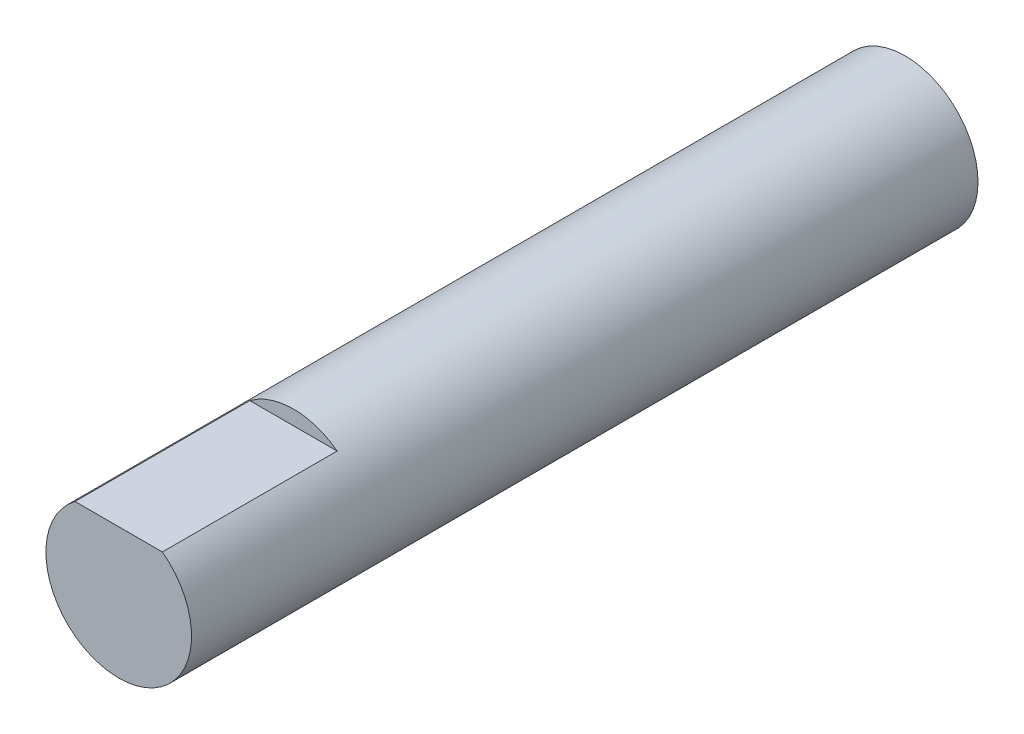
ISO-10303-21;
HEADER;
FILE_DESCRIPTION(('STEP AP214'),'2;1');
FILE_NAME('part.step','',(''),(''),'','','');
FILE_SCHEMA(('AUTOMOTIVE_DESIGN { 1 0 10303 214 1 1 1 1 }'));
ENDSEC;
DATA;
#1=APPLICATION_CONTEXT('core data for automotive mechanical design processes');
#2=APPLICATION_PROTOCOL_DEFINITION('international standard','automotive_design',2000,#1);
#3=PRODUCT_CONTEXT('',#1,'mechanical');
#4=PRODUCT('Part','Part','',(#3));
#5=PRODUCT_RELATED_PRODUCT_CATEGORY('part','',(#4));
#6=PRODUCT_DEFINITION_FORMATION('','',#4);
#7=PRODUCT_DEFINITION_CONTEXT('part definition',#1,'design');
#8=PRODUCT_DEFINITION('design','',#6,#7);
#9=PRODUCT_DEFINITION_SHAPE('','',#8);
#10=(LENGTH_UNIT() NAMED_UNIT(*) SI_UNIT(.MILLI.,.METRE.));
#11=(NAMED_UNIT(*) PLANE_ANGLE_UNIT() SI_UNIT($,.RADIAN.));
#12=(NAMED_UNIT(*) SI_UNIT($,.STERADIAN.) SOLID_ANGLE_UNIT());
#13=UNCERTAINTY_MEASURE_WITH_UNIT(LENGTH_MEASURE(1.E-05),#10,'distance_accuracy_value','');
#14=(GEOMETRIC_REPRESENTATION_CONTEXT(3) GLOBAL_UNCERTAINTY_ASSIGNED_CONTEXT((#13)) GLOBAL_UNIT_ASSIGNED_CONTEXT((#10,
#11,#12)) REPRESENTATION_CONTEXT('',''));
#15=CARTESIAN_POINT('',(0.,0.,0.));
#16=DIRECTION('',(0.,0.,1.));
#17=DIRECTION('',(1.,0.,0.));
#18=AXIS2_PLACEMENT_3D('',#15,#16,#17);
#19=CARTESIAN_POINT('',(0.,0.,27.));
#20=DIRECTION('',(0.,0.,-1.));
#21=DIRECTION('',(-1.,0.,0.));
#22=AXIS2_PLACEMENT_3D('',#19,#20,#21);
#23=CYLINDRICAL_SURFACE('',#22,2.5);
#24=CARTESIAN_POINT('',(0.,0.,27.));
#25=DIRECTION('',(0.,0.,1.));
#26=DIRECTION('',(1.,0.,0.));
#27=AXIS2_PLACEMENT_3D('',#24,#25,#26);
#28=CIRCLE('',#27,2.5);
#29=CARTESIAN_POINT('',(-1.5,2.,27.));
#30=VERTEX_POINT('',#29);
#31=CARTESIAN_POINT('',(1.5,2.,27.));
#32=VERTEX_POINT('',#31);
#33=EDGE_CURVE('E11',#30,#32,#28,.T.);
#34=ORIENTED_EDGE('',*,*,#33,.F.);
#35=DIRECTION('',(0.,0.,1.));
#36=VECTOR('',#35,1.);
#37=CARTESIAN_POINT('',(-1.5,2.,21.));
#38=LINE('',#37,#36);
#39=CARTESIAN_POINT('',(-1.5,2.,21.));
#40=VERTEX_POINT('',#39);
#41=EDGE_CURVE('E60',#40,#30,#38,.T.);
#42=ORIENTED_EDGE('',*,*,#41,.F.);
#43=CARTESIAN_POINT('',(0.,0.,21.));
#44=DIRECTION('',(0.,0.,1.));
#45=DIRECTION('',(1.,0.,0.));
#46=AXIS2_PLACEMENT_3D('',#43,#44,#45);
#47=CIRCLE('',#46,2.5);
#48=CARTESIAN_POINT('',(1.5,2.,21.));
#49=VERTEX_POINT('',#48);
#50=EDGE_CURVE('E76',#49,#40,#47,.T.);
#51=ORIENTED_EDGE('',*,*,#50,.F.);
#52=DIRECTION('',(0.,0.,1.));
#53=VECTOR('',#52,1.);
#54=CARTESIAN_POINT('',(1.5,2.,21.));
#55=LINE('',#54,#53);
#56=EDGE_CURVE('E66',#49,#32,#55,.T.);
#57=ORIENTED_EDGE('',*,*,#56,.T.);
#58=EDGE_LOOP('',(#34,#42,#51,#57));
#59=FACE_BOUND('',#58,.T.);
#60=CARTESIAN_POINT('',(0.,0.,0.));
#61=DIRECTION('',(0.,0.,1.));
#62=DIRECTION('',(1.,0.,0.));
#63=AXIS2_PLACEMENT_3D('',#60,#61,#62);
#64=CIRCLE('',#63,2.5);
#65=CARTESIAN_POINT('',(2.5,0.,0.));
#66=VERTEX_POINT('',#65);
#67=EDGE_CURVE('E48',#66,#66,#64,.T.);
#68=ORIENTED_EDGE('',*,*,#67,.T.);
#69=EDGE_LOOP('',(#68));
#70=FACE_BOUND('',#69,.T.);
#71=ADVANCED_FACE('F45',(#59,#70),#23,.T.);
#72=CARTESIAN_POINT('',(0.,0.,27.));
#73=DIRECTION('',(0.,0.,1.));
#74=DIRECTION('',(1.,0.,0.));
#75=AXIS2_PLACEMENT_3D('',#72,#73,#74);
#76=PLANE('',#75);
#77=DIRECTION('',(1.,0.,0.));
#78=VECTOR('',#77,1.);
#79=CARTESIAN_POINT('',(0.,2.,27.));
#80=LINE('',#79,#78);
#81=EDGE_CURVE('E71',#30,#32,#80,.T.);
#82=ORIENTED_EDGE('',*,*,#81,.F.);
#83=ORIENTED_EDGE('',*,*,#33,.T.);
#84=EDGE_LOOP('',(#82,#83));
#85=FACE_BOUND('',#84,.T.);
#86=ADVANCED_FACE('F83',(#85),#76,.T.);
#87=CARTESIAN_POINT('',(0.,0.,0.));
#88=DIRECTION('',(0.,0.,1.));
#89=DIRECTION('',(1.,0.,0.));
#90=AXIS2_PLACEMENT_3D('',#87,#88,#89);
#91=PLANE('',#90);
#92=ORIENTED_EDGE('',*,*,#67,.F.);
#93=EDGE_LOOP('',(#92));
#94=FACE_BOUND('',#93,.T.);
#95=ADVANCED_FACE('F85',(#94),#91,.F.);
#96=CARTESIAN_POINT('',(0.,2.,21.));
#97=DIRECTION('',(0.,-1.,0.));
#98=DIRECTION('',(0.,0.,-1.));
#99=AXIS2_PLACEMENT_3D('',#96,#97,#98);
#100=PLANE('',#99);
#101=ORIENTED_EDGE('',*,*,#81,.T.);
#102=ORIENTED_EDGE('',*,*,#56,.F.);
#103=DIRECTION('',(1.,0.,0.));
#104=VECTOR('',#103,1.);
#105=CARTESIAN_POINT('',(0.,2.,21.));
#106=LINE('',#105,#104);
#107=EDGE_CURVE('E100',#40,#49,#106,.T.);
#108=ORIENTED_EDGE('',*,*,#107,.F.);
#109=ORIENTED_EDGE('',*,*,#41,.T.);
#110=EDGE_LOOP('',(#101,#102,#108,#109));
#111=FACE_BOUND('',#110,.T.);
#112=ADVANCED_FACE('F72',(#111),#100,.F.);
#113=CARTESIAN_POINT('',(0.,0.,21.));
#114=DIRECTION('',(0.,0.,1.));
#115=DIRECTION('',(1.,0.,0.));
#116=AXIS2_PLACEMENT_3D('',#113,#114,#115);
#117=PLANE('',#116);
#118=ORIENTED_EDGE('',*,*,#50,.T.);
#119=ORIENTED_EDGE('',*,*,#107,.T.);
#120=EDGE_LOOP('',(#118,#119));
#121=FACE_BOUND('',#120,.T.);
#122=ADVANCED_FACE('F95',(#121),#117,.T.);
#123=CLOSED_SHELL('',(#71,#86,#95,#112,#122));
#124=MANIFOLD_SOLID_BREP('B2',#123);
#125=ADVANCED_BREP_SHAPE_REPRESENTATION('',(#18,#124),#14);
#126=SHAPE_DEFINITION_REPRESENTATION(#9,#125);
ENDSEC;
END-ISO-10303-21;
